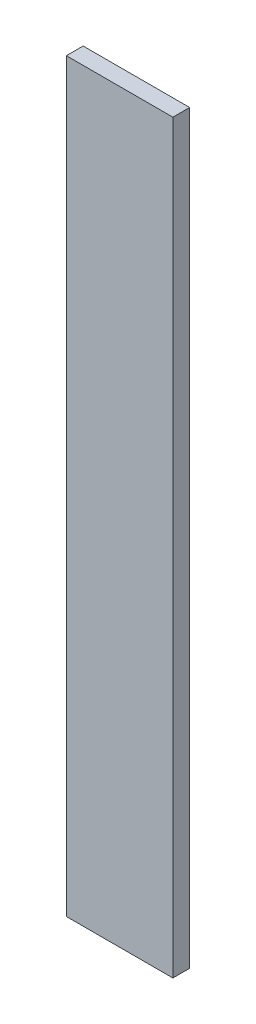
ISO-10303-21;
HEADER;
FILE_DESCRIPTION(('STEP AP214'),'2;1');
FILE_NAME('part.step','',(''),(''),'','','');
FILE_SCHEMA(('AUTOMOTIVE_DESIGN { 1 0 10303 214 1 1 1 1 }'));
ENDSEC;
DATA;
#1=APPLICATION_CONTEXT('core data for automotive mechanical design processes');
#2=APPLICATION_PROTOCOL_DEFINITION('international standard','automotive_design',2000,#1);
#3=PRODUCT_CONTEXT('',#1,'mechanical');
#4=PRODUCT('Part','Part','',(#3));
#5=PRODUCT_RELATED_PRODUCT_CATEGORY('part','',(#4));
#6=PRODUCT_DEFINITION_FORMATION('','',#4);
#7=PRODUCT_DEFINITION_CONTEXT('part definition',#1,'design');
#8=PRODUCT_DEFINITION('design','',#6,#7);
#9=PRODUCT_DEFINITION_SHAPE('','',#8);
#10=(LENGTH_UNIT() NAMED_UNIT(*) SI_UNIT(.MILLI.,.METRE.));
#11=(NAMED_UNIT(*) PLANE_ANGLE_UNIT() SI_UNIT($,.RADIAN.));
#12=(NAMED_UNIT(*) SI_UNIT($,.STERADIAN.) SOLID_ANGLE_UNIT());
#13=UNCERTAINTY_MEASURE_WITH_UNIT(LENGTH_MEASURE(1.E-05),#10,'distance_accuracy_value','');
#14=(GEOMETRIC_REPRESENTATION_CONTEXT(3) GLOBAL_UNCERTAINTY_ASSIGNED_CONTEXT((#13)) GLOBAL_UNIT_ASSIGNED_CONTEXT((#10,
#11,#12)) REPRESENTATION_CONTEXT('',''));
#15=CARTESIAN_POINT('',(0.,0.,0.));
#16=DIRECTION('',(0.,0.,1.));
#17=DIRECTION('',(1.,0.,0.));
#18=AXIS2_PLACEMENT_3D('',#15,#16,#17);
#19=CARTESIAN_POINT('',(-0.127,0.889,0.03999992));
#20=DIRECTION('',(0.,0.,1.));
#21=DIRECTION('',(1.,0.,0.));
#22=AXIS2_PLACEMENT_3D('',#19,#20,#21);
#23=PLANE('',#22);
#24=DIRECTION('',(0.,1.,0.));
#25=VECTOR('',#24,1.);
#26=CARTESIAN_POINT('',(0.127,0.889,0.03999992));
#27=LINE('',#26,#25);
#28=CARTESIAN_POINT('',(0.127,0.889,0.03999992));
#29=VERTEX_POINT('',#28);
#30=CARTESIAN_POINT('',(0.127,-0.889,0.03999992));
#31=VERTEX_POINT('',#30);
#32=EDGE_CURVE('E53',#29,#31,#27,.F.);
#33=ORIENTED_EDGE('',*,*,#32,.F.);
#34=DIRECTION('',(1.,0.,0.));
#35=VECTOR('',#34,1.);
#36=CARTESIAN_POINT('',(-0.127,0.889,0.03999992));
#37=LINE('',#36,#35);
#38=CARTESIAN_POINT('',(-0.127,0.889,0.03999992));
#39=VERTEX_POINT('',#38);
#40=EDGE_CURVE('E20',#29,#39,#37,.F.);
#41=ORIENTED_EDGE('',*,*,#40,.T.);
#42=DIRECTION('',(0.,1.,0.));
#43=VECTOR('',#42,1.);
#44=CARTESIAN_POINT('',(-0.127,-0.889,0.03999992));
#45=LINE('',#44,#43);
#46=CARTESIAN_POINT('',(-0.127,-0.889,0.03999992));
#47=VERTEX_POINT('',#46);
#48=EDGE_CURVE('E67',#47,#39,#45,.T.);
#49=ORIENTED_EDGE('',*,*,#48,.F.);
#50=DIRECTION('',(1.,0.,0.));
#51=VECTOR('',#50,1.);
#52=CARTESIAN_POINT('',(0.127,-0.889,0.03999992));
#53=LINE('',#52,#51);
#54=EDGE_CURVE('E58',#31,#47,#53,.F.);
#55=ORIENTED_EDGE('',*,*,#54,.F.);
#56=EDGE_LOOP('',(#33,#41,#49,#55));
#57=FACE_BOUND('',#56,.T.);
#58=ADVANCED_FACE('F17',(#57),#23,.T.);
#59=CARTESIAN_POINT('',(-0.127,-0.889,0.));
#60=DIRECTION('',(-1.,0.,0.));
#61=DIRECTION('',(0.,0.,1.));
#62=AXIS2_PLACEMENT_3D('',#59,#60,#61);
#63=PLANE('',#62);
#64=DIRECTION('',(0.,0.,1.));
#65=VECTOR('',#64,1.);
#66=CARTESIAN_POINT('',(-0.127,0.889,0.));
#67=LINE('',#66,#65);
#68=CARTESIAN_POINT('',(-0.127,0.889,0.));
#69=VERTEX_POINT('',#68);
#70=EDGE_CURVE('E80',#69,#39,#67,.T.);
#71=ORIENTED_EDGE('',*,*,#70,.F.);
#72=DIRECTION('',(0.,1.,0.));
#73=VECTOR('',#72,1.);
#74=CARTESIAN_POINT('',(-0.127,0.889,0.));
#75=LINE('',#74,#73);
#76=CARTESIAN_POINT('',(-0.127,-0.889,0.));
#77=VERTEX_POINT('',#76);
#78=EDGE_CURVE('E75',#69,#77,#75,.F.);
#79=ORIENTED_EDGE('',*,*,#78,.T.);
#80=DIRECTION('',(0.,0.,-1.));
#81=VECTOR('',#80,1.);
#82=CARTESIAN_POINT('',(-0.127,-0.889,0.));
#83=LINE('',#82,#81);
#84=EDGE_CURVE('E63',#47,#77,#83,.T.);
#85=ORIENTED_EDGE('',*,*,#84,.F.);
#86=ORIENTED_EDGE('',*,*,#48,.T.);
#87=EDGE_LOOP('',(#71,#79,#85,#86));
#88=FACE_BOUND('',#87,.T.);
#89=ADVANCED_FACE('F74',(#88),#63,.T.);
#90=CARTESIAN_POINT('',(0.127,-0.889,0.));
#91=DIRECTION('',(0.,-1.,0.));
#92=DIRECTION('',(0.,0.,-1.));
#93=AXIS2_PLACEMENT_3D('',#90,#91,#92);
#94=PLANE('',#93);
#95=ORIENTED_EDGE('',*,*,#84,.T.);
#96=DIRECTION('',(1.,0.,0.));
#97=VECTOR('',#96,1.);
#98=CARTESIAN_POINT('',(-0.127,-0.889,0.));
#99=LINE('',#98,#97);
#100=CARTESIAN_POINT('',(0.127,-0.889,0.));
#101=VERTEX_POINT('',#100);
#102=EDGE_CURVE('E84',#77,#101,#99,.T.);
#103=ORIENTED_EDGE('',*,*,#102,.T.);
#104=DIRECTION('',(0.,0.,-1.));
#105=VECTOR('',#104,1.);
#106=CARTESIAN_POINT('',(0.127,-0.889,0.));
#107=LINE('',#106,#105);
#108=EDGE_CURVE('E65',#31,#101,#107,.T.);
#109=ORIENTED_EDGE('',*,*,#108,.F.);
#110=ORIENTED_EDGE('',*,*,#54,.T.);
#111=EDGE_LOOP('',(#95,#103,#109,#110));
#112=FACE_BOUND('',#111,.T.);
#113=ADVANCED_FACE('F60',(#112),#94,.T.);
#114=CARTESIAN_POINT('',(0.127,0.889,0.));
#115=DIRECTION('',(1.,0.,0.));
#116=DIRECTION('',(0.,0.,-1.));
#117=AXIS2_PLACEMENT_3D('',#114,#115,#116);
#118=PLANE('',#117);
#119=ORIENTED_EDGE('',*,*,#108,.T.);
#120=DIRECTION('',(0.,1.,0.));
#121=VECTOR('',#120,1.);
#122=CARTESIAN_POINT('',(0.127,0.889,0.));
#123=LINE('',#122,#121);
#124=CARTESIAN_POINT('',(0.127,0.889,0.));
#125=VERTEX_POINT('',#124);
#126=EDGE_CURVE('E26',#101,#125,#123,.T.);
#127=ORIENTED_EDGE('',*,*,#126,.T.);
#128=DIRECTION('',(0.,0.,1.));
#129=VECTOR('',#128,1.);
#130=CARTESIAN_POINT('',(0.127,0.889,0.));
#131=LINE('',#130,#129);
#132=EDGE_CURVE('E34',#29,#125,#131,.F.);
#133=ORIENTED_EDGE('',*,*,#132,.F.);
#134=ORIENTED_EDGE('',*,*,#32,.T.);
#135=EDGE_LOOP('',(#119,#127,#133,#134));
#136=FACE_BOUND('',#135,.T.);
#137=ADVANCED_FACE('F88',(#136),#118,.T.);
#138=CARTESIAN_POINT('',(-0.127,0.889,0.));
#139=DIRECTION('',(0.,1.,0.));
#140=DIRECTION('',(0.,0.,1.));
#141=AXIS2_PLACEMENT_3D('',#138,#139,#140);
#142=PLANE('',#141);
#143=ORIENTED_EDGE('',*,*,#132,.T.);
#144=DIRECTION('',(1.,0.,0.));
#145=VECTOR('',#144,1.);
#146=CARTESIAN_POINT('',(-0.127,0.889,0.));
#147=LINE('',#146,#145);
#148=EDGE_CURVE('E11',#125,#69,#147,.F.);
#149=ORIENTED_EDGE('',*,*,#148,.T.);
#150=ORIENTED_EDGE('',*,*,#70,.T.);
#151=ORIENTED_EDGE('',*,*,#40,.F.);
#152=EDGE_LOOP('',(#143,#149,#150,#151));
#153=FACE_BOUND('',#152,.T.);
#154=ADVANCED_FACE('F91',(#153),#142,.T.);
#155=CARTESIAN_POINT('',(-0.127,0.889,0.));
#156=DIRECTION('',(0.,0.,1.));
#157=DIRECTION('',(1.,0.,0.));
#158=AXIS2_PLACEMENT_3D('',#155,#156,#157);
#159=PLANE('',#158);
#160=ORIENTED_EDGE('',*,*,#126,.F.);
#161=ORIENTED_EDGE('',*,*,#102,.F.);
#162=ORIENTED_EDGE('',*,*,#78,.F.);
#163=ORIENTED_EDGE('',*,*,#148,.F.);
#164=EDGE_LOOP('',(#160,#161,#162,#163));
#165=FACE_BOUND('',#164,.T.);
#166=ADVANCED_FACE('F90',(#165),#159,.F.);
#167=CLOSED_SHELL('',(#58,#89,#113,#137,#154,#166));
#168=MANIFOLD_SOLID_BREP('B1',#167);
#169=ADVANCED_BREP_SHAPE_REPRESENTATION('',(#18,#168),#14);
#170=SHAPE_DEFINITION_REPRESENTATION(#9,#169);
ENDSEC;
END-ISO-10303-21;
